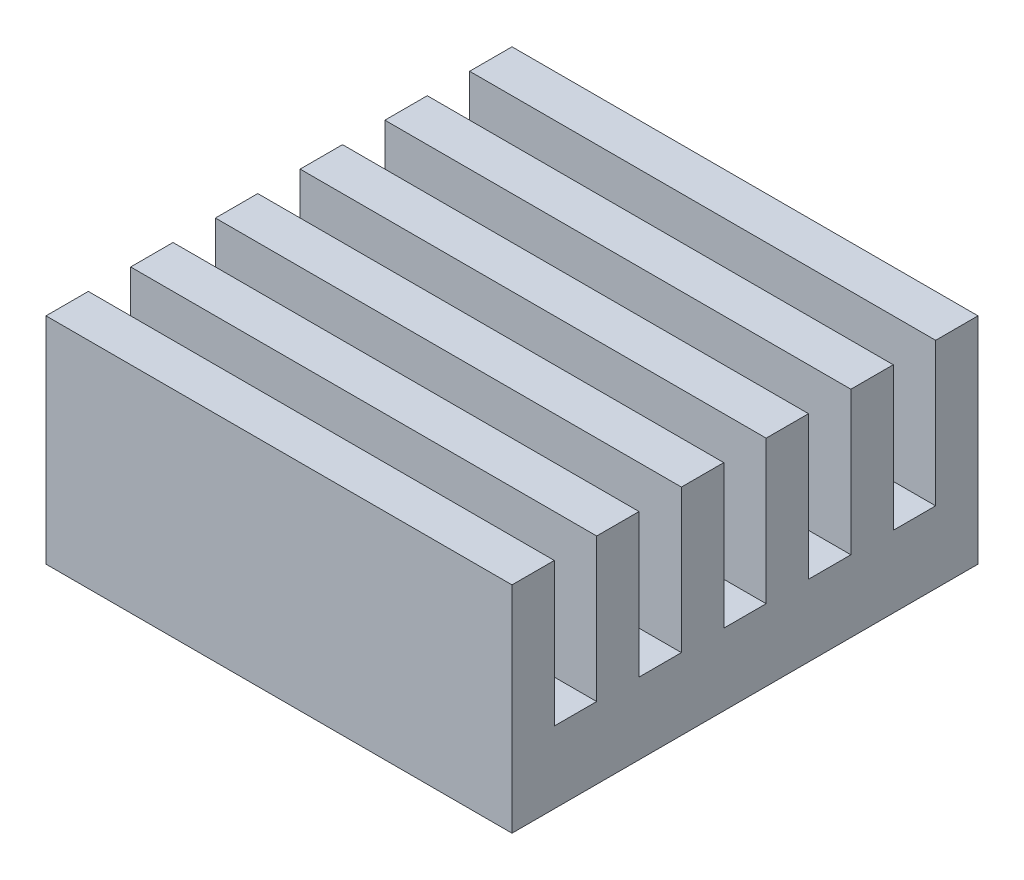
ISO-10303-21;
HEADER;
FILE_DESCRIPTION(('STEP AP214'),'2;1');
FILE_NAME('part.step','',(''),(''),'','','');
FILE_SCHEMA(('AUTOMOTIVE_DESIGN { 1 0 10303 214 1 1 1 1 }'));
ENDSEC;
DATA;
#1=APPLICATION_CONTEXT('core data for automotive mechanical design processes');
#2=APPLICATION_PROTOCOL_DEFINITION('international standard','automotive_design',2000,#1);
#3=PRODUCT_CONTEXT('',#1,'mechanical');
#4=PRODUCT('Part','Part','',(#3));
#5=PRODUCT_RELATED_PRODUCT_CATEGORY('part','',(#4));
#6=PRODUCT_DEFINITION_FORMATION('','',#4);
#7=PRODUCT_DEFINITION_CONTEXT('part definition',#1,'design');
#8=PRODUCT_DEFINITION('design','',#6,#7);
#9=PRODUCT_DEFINITION_SHAPE('','',#8);
#10=(LENGTH_UNIT() NAMED_UNIT(*) SI_UNIT(.MILLI.,.METRE.));
#11=(NAMED_UNIT(*) PLANE_ANGLE_UNIT() SI_UNIT($,.RADIAN.));
#12=(NAMED_UNIT(*) SI_UNIT($,.STERADIAN.) SOLID_ANGLE_UNIT());
#13=UNCERTAINTY_MEASURE_WITH_UNIT(LENGTH_MEASURE(1.E-05),#10,'distance_accuracy_value','');
#14=(GEOMETRIC_REPRESENTATION_CONTEXT(3) GLOBAL_UNCERTAINTY_ASSIGNED_CONTEXT((#13)) GLOBAL_UNIT_ASSIGNED_CONTEXT((#10,
#11,#12)) REPRESENTATION_CONTEXT('',''));
#15=CARTESIAN_POINT('',(0.,0.,0.));
#16=DIRECTION('',(0.,0.,1.));
#17=DIRECTION('',(1.,0.,0.));
#18=AXIS2_PLACEMENT_3D('',#15,#16,#17);
#19=CARTESIAN_POINT('',(0.,30.,0.));
#20=DIRECTION('',(0.,-1.,0.));
#21=DIRECTION('',(0.,0.,-1.));
#22=AXIS2_PLACEMENT_3D('',#19,#20,#21);
#23=PLANE('',#22);
#24=DIRECTION('',(0.,0.,1.));
#25=VECTOR('',#24,1.);
#26=CARTESIAN_POINT('',(-32.5,30.,32.5));
#27=LINE('',#26,#25);
#28=CARTESIAN_POINT('',(-32.5,30.,-32.5));
#29=VERTEX_POINT('',#28);
#30=CARTESIAN_POINT('',(-32.5,30.,-26.59));
#31=VERTEX_POINT('',#30);
#32=EDGE_CURVE('E387',#29,#31,#27,.T.);
#33=ORIENTED_EDGE('',*,*,#32,.T.);
#34=DIRECTION('',(-1.,0.,0.));
#35=VECTOR('',#34,1.);
#36=CARTESIAN_POINT('',(-32.5,30.,-26.59));
#37=LINE('',#36,#35);
#38=CARTESIAN_POINT('',(32.5,30.,-26.59));
#39=VERTEX_POINT('',#38);
#40=EDGE_CURVE('E256',#39,#31,#37,.T.);
#41=ORIENTED_EDGE('',*,*,#40,.F.);
#42=DIRECTION('',(0.,0.,-1.));
#43=VECTOR('',#42,1.);
#44=CARTESIAN_POINT('',(32.5,30.,32.5));
#45=LINE('',#44,#43);
#46=CARTESIAN_POINT('',(32.5,30.,-32.5));
#47=VERTEX_POINT('',#46);
#48=EDGE_CURVE('E384',#39,#47,#45,.T.);
#49=ORIENTED_EDGE('',*,*,#48,.T.);
#50=DIRECTION('',(-1.,0.,0.));
#51=VECTOR('',#50,1.);
#52=CARTESIAN_POINT('',(-32.5,30.,-32.5));
#53=LINE('',#52,#51);
#54=EDGE_CURVE('E382',#47,#29,#53,.T.);
#55=ORIENTED_EDGE('',*,*,#54,.T.);
#56=EDGE_LOOP('',(#33,#41,#49,#55));
#57=FACE_BOUND('',#56,.T.);
#58=ADVANCED_FACE('F39',(#57),#23,.F.);
#59=CARTESIAN_POINT('',(32.5000000000001,30.,-14.77));
#60=VERTEX_POINT('',#59);
#61=CARTESIAN_POINT('',(32.5,30.,-20.68));
#62=VERTEX_POINT('',#61);
#63=EDGE_CURVE('E469',#60,#62,#45,.T.);
#64=ORIENTED_EDGE('',*,*,#63,.T.);
#65=DIRECTION('',(1.,0.,0.));
#66=VECTOR('',#65,1.);
#67=CARTESIAN_POINT('',(-32.5,30.,-20.68));
#68=LINE('',#67,#66);
#69=CARTESIAN_POINT('',(-32.5,30.,-20.68));
#70=VERTEX_POINT('',#69);
#71=EDGE_CURVE('E265',#70,#62,#68,.T.);
#72=ORIENTED_EDGE('',*,*,#71,.F.);
#73=CARTESIAN_POINT('',(-32.4999999999999,30.,-14.77));
#74=VERTEX_POINT('',#73);
#75=EDGE_CURVE('E391',#70,#74,#27,.T.);
#76=ORIENTED_EDGE('',*,*,#75,.T.);
#77=DIRECTION('',(-1.,0.,0.));
#78=VECTOR('',#77,1.);
#79=CARTESIAN_POINT('',(-32.4999999999999,30.,-14.77));
#80=LINE('',#79,#78);
#81=EDGE_CURVE('E293',#60,#74,#80,.T.);
#82=ORIENTED_EDGE('',*,*,#81,.F.);
#83=EDGE_LOOP('',(#64,#72,#76,#82));
#84=FACE_BOUND('',#83,.T.);
#85=ADVANCED_FACE('F458',(#84),#23,.F.);
#86=CARTESIAN_POINT('',(32.5000000000003,30.,-2.95));
#87=VERTEX_POINT('',#86);
#88=CARTESIAN_POINT('',(32.5000000000001,30.,-8.86));
#89=VERTEX_POINT('',#88);
#90=EDGE_CURVE('E471',#87,#89,#45,.T.);
#91=ORIENTED_EDGE('',*,*,#90,.T.);
#92=DIRECTION('',(1.,0.,0.));
#93=VECTOR('',#92,1.);
#94=CARTESIAN_POINT('',(-32.4999999999999,30.,-8.86));
#95=LINE('',#94,#93);
#96=CARTESIAN_POINT('',(-32.5,30.,-8.86000000000001));
#97=VERTEX_POINT('',#96);
#98=EDGE_CURVE('E283',#97,#89,#95,.T.);
#99=ORIENTED_EDGE('',*,*,#98,.F.);
#100=CARTESIAN_POINT('',(-32.4999999999997,30.,-2.95));
#101=VERTEX_POINT('',#100);
#102=EDGE_CURVE('E442',#97,#101,#27,.T.);
#103=ORIENTED_EDGE('',*,*,#102,.T.);
#104=DIRECTION('',(-1.,0.,0.));
#105=VECTOR('',#104,1.);
#106=CARTESIAN_POINT('',(-32.4999999999997,30.,-2.95));
#107=LINE('',#106,#105);
#108=EDGE_CURVE('E319',#87,#101,#107,.T.);
#109=ORIENTED_EDGE('',*,*,#108,.F.);
#110=EDGE_LOOP('',(#91,#99,#103,#109));
#111=FACE_BOUND('',#110,.T.);
#112=ADVANCED_FACE('F490',(#111),#23,.F.);
#113=CARTESIAN_POINT('',(32.5000000000004,30.,8.87));
#114=VERTEX_POINT('',#113);
#115=CARTESIAN_POINT('',(32.5000000000003,30.,2.96));
#116=VERTEX_POINT('',#115);
#117=EDGE_CURVE('E473',#114,#116,#45,.T.);
#118=ORIENTED_EDGE('',*,*,#117,.T.);
#119=DIRECTION('',(1.,0.,0.));
#120=VECTOR('',#119,1.);
#121=CARTESIAN_POINT('',(-32.4999999999997,30.,2.96));
#122=LINE('',#121,#120);
#123=CARTESIAN_POINT('',(-32.5,30.,2.96));
#124=VERTEX_POINT('',#123);
#125=EDGE_CURVE('E309',#124,#116,#122,.T.);
#126=ORIENTED_EDGE('',*,*,#125,.F.);
#127=CARTESIAN_POINT('',(-32.4999999999996,30.,8.87));
#128=VERTEX_POINT('',#127);
#129=EDGE_CURVE('E436',#124,#128,#27,.T.);
#130=ORIENTED_EDGE('',*,*,#129,.T.);
#131=DIRECTION('',(-1.,0.,0.));
#132=VECTOR('',#131,1.);
#133=CARTESIAN_POINT('',(-32.4999999999996,30.,8.87));
#134=LINE('',#133,#132);
#135=EDGE_CURVE('E345',#114,#128,#134,.T.);
#136=ORIENTED_EDGE('',*,*,#135,.F.);
#137=EDGE_LOOP('',(#118,#126,#130,#136));
#138=FACE_BOUND('',#137,.T.);
#139=ADVANCED_FACE('F502',(#138),#23,.F.);
#140=CARTESIAN_POINT('',(32.5000000000005,30.,20.69));
#141=VERTEX_POINT('',#140);
#142=CARTESIAN_POINT('',(32.5000000000004,30.,14.78));
#143=VERTEX_POINT('',#142);
#144=EDGE_CURVE('E383',#141,#143,#45,.T.);
#145=ORIENTED_EDGE('',*,*,#144,.T.);
#146=DIRECTION('',(1.,0.,0.));
#147=VECTOR('',#146,1.);
#148=CARTESIAN_POINT('',(-32.4999999999996,30.,14.78));
#149=LINE('',#148,#147);
#150=CARTESIAN_POINT('',(-32.5,30.,14.78));
#151=VERTEX_POINT('',#150);
#152=EDGE_CURVE('E335',#151,#143,#149,.T.);
#153=ORIENTED_EDGE('',*,*,#152,.F.);
#154=CARTESIAN_POINT('',(-32.4999999999995,30.,20.69));
#155=VERTEX_POINT('',#154);
#156=EDGE_CURVE('E434',#151,#155,#27,.T.);
#157=ORIENTED_EDGE('',*,*,#156,.T.);
#158=DIRECTION('',(-1.,0.,0.));
#159=VECTOR('',#158,1.);
#160=CARTESIAN_POINT('',(-32.4999999999995,30.,20.69));
#161=LINE('',#160,#159);
#162=EDGE_CURVE('E244',#141,#155,#161,.T.);
#163=ORIENTED_EDGE('',*,*,#162,.F.);
#164=EDGE_LOOP('',(#145,#153,#157,#163));
#165=FACE_BOUND('',#164,.T.);
#166=ADVANCED_FACE('F484',(#165),#23,.F.);
#167=CARTESIAN_POINT('',(32.5,30.,32.5));
#168=DIRECTION('',(-1.,0.,0.));
#169=DIRECTION('',(0.,0.,1.));
#170=AXIS2_PLACEMENT_3D('',#167,#168,#169);
#171=PLANE('',#170);
#172=ORIENTED_EDGE('',*,*,#48,.F.);
#173=DIRECTION('',(0.,1.,0.));
#174=VECTOR('',#173,1.);
#175=CARTESIAN_POINT('',(32.5,10.,-26.59));
#176=LINE('',#175,#174);
#177=CARTESIAN_POINT('',(32.5,10.,-26.59));
#178=VERTEX_POINT('',#177);
#179=EDGE_CURVE('E273',#178,#39,#176,.T.);
#180=ORIENTED_EDGE('',*,*,#179,.F.);
#181=DIRECTION('',(0.,0.,-1.));
#182=VECTOR('',#181,1.);
#183=CARTESIAN_POINT('',(32.5,10.,-26.59));
#184=LINE('',#183,#182);
#185=CARTESIAN_POINT('',(32.5,10.,-20.68));
#186=VERTEX_POINT('',#185);
#187=EDGE_CURVE('E259',#186,#178,#184,.T.);
#188=ORIENTED_EDGE('',*,*,#187,.F.);
#189=DIRECTION('',(0.,1.,0.));
#190=VECTOR('',#189,1.);
#191=CARTESIAN_POINT('',(32.5,10.,-20.68));
#192=LINE('',#191,#190);
#193=EDGE_CURVE('E275',#186,#62,#192,.T.);
#194=ORIENTED_EDGE('',*,*,#193,.T.);
#195=ORIENTED_EDGE('',*,*,#63,.F.);
#196=DIRECTION('',(0.,1.,0.));
#197=VECTOR('',#196,1.);
#198=CARTESIAN_POINT('',(32.5000000000001,10.,-14.77));
#199=LINE('',#198,#197);
#200=CARTESIAN_POINT('',(32.5000000000001,10.,-14.77));
#201=VERTEX_POINT('',#200);
#202=EDGE_CURVE('E267',#201,#60,#199,.T.);
#203=ORIENTED_EDGE('',*,*,#202,.F.);
#204=DIRECTION('',(0.,0.,-1.));
#205=VECTOR('',#204,1.);
#206=CARTESIAN_POINT('',(32.5000000000001,10.,-14.77));
#207=LINE('',#206,#205);
#208=CARTESIAN_POINT('',(32.5000000000001,10.,-8.86));
#209=VERTEX_POINT('',#208);
#210=EDGE_CURVE('E289',#209,#201,#207,.T.);
#211=ORIENTED_EDGE('',*,*,#210,.F.);
#212=DIRECTION('',(0.,1.,0.));
#213=VECTOR('',#212,1.);
#214=CARTESIAN_POINT('',(32.5000000000001,10.,-8.86));
#215=LINE('',#214,#213);
#216=EDGE_CURVE('E298',#209,#89,#215,.T.);
#217=ORIENTED_EDGE('',*,*,#216,.T.);
#218=ORIENTED_EDGE('',*,*,#90,.F.);
#219=DIRECTION('',(0.,1.,0.));
#220=VECTOR('',#219,1.);
#221=CARTESIAN_POINT('',(32.5000000000003,10.,-2.95));
#222=LINE('',#221,#220);
#223=CARTESIAN_POINT('',(32.5000000000003,10.,-2.95));
#224=VERTEX_POINT('',#223);
#225=EDGE_CURVE('E295',#224,#87,#222,.T.);
#226=ORIENTED_EDGE('',*,*,#225,.F.);
#227=DIRECTION('',(0.,0.,-1.));
#228=VECTOR('',#227,1.);
#229=CARTESIAN_POINT('',(32.5000000000003,10.,-2.95));
#230=LINE('',#229,#228);
#231=CARTESIAN_POINT('',(32.5000000000003,10.,2.96));
#232=VERTEX_POINT('',#231);
#233=EDGE_CURVE('E315',#232,#224,#230,.T.);
#234=ORIENTED_EDGE('',*,*,#233,.F.);
#235=DIRECTION('',(0.,1.,0.));
#236=VECTOR('',#235,1.);
#237=CARTESIAN_POINT('',(32.5000000000003,10.,2.96));
#238=LINE('',#237,#236);
#239=EDGE_CURVE('E324',#232,#116,#238,.T.);
#240=ORIENTED_EDGE('',*,*,#239,.T.);
#241=ORIENTED_EDGE('',*,*,#117,.F.);
#242=DIRECTION('',(0.,1.,0.));
#243=VECTOR('',#242,1.);
#244=CARTESIAN_POINT('',(32.5000000000004,10.,8.87));
#245=LINE('',#244,#243);
#246=CARTESIAN_POINT('',(32.5000000000004,10.,8.87));
#247=VERTEX_POINT('',#246);
#248=EDGE_CURVE('E321',#247,#114,#245,.T.);
#249=ORIENTED_EDGE('',*,*,#248,.F.);
#250=DIRECTION('',(0.,0.,-1.));
#251=VECTOR('',#250,1.);
#252=CARTESIAN_POINT('',(32.5000000000004,10.,8.87));
#253=LINE('',#252,#251);
#254=CARTESIAN_POINT('',(32.5000000000004,10.,14.78));
#255=VERTEX_POINT('',#254);
#256=EDGE_CURVE('E341',#255,#247,#253,.T.);
#257=ORIENTED_EDGE('',*,*,#256,.F.);
#258=DIRECTION('',(0.,1.,0.));
#259=VECTOR('',#258,1.);
#260=CARTESIAN_POINT('',(32.5000000000004,10.,14.78));
#261=LINE('',#260,#259);
#262=EDGE_CURVE('E350',#255,#143,#261,.T.);
#263=ORIENTED_EDGE('',*,*,#262,.T.);
#264=ORIENTED_EDGE('',*,*,#144,.F.);
#265=DIRECTION('',(0.,1.,0.));
#266=VECTOR('',#265,1.);
#267=CARTESIAN_POINT('',(32.5000000000005,10.,20.69));
#268=LINE('',#267,#266);
#269=CARTESIAN_POINT('',(32.5000000000005,10.,20.69));
#270=VERTEX_POINT('',#269);
#271=EDGE_CURVE('E347',#270,#141,#268,.T.);
#272=ORIENTED_EDGE('',*,*,#271,.F.);
#273=DIRECTION('',(0.,0.,-1.));
#274=VECTOR('',#273,1.);
#275=CARTESIAN_POINT('',(32.5000000000005,10.,20.69));
#276=LINE('',#275,#274);
#277=CARTESIAN_POINT('',(32.5000000000005,10.,26.6));
#278=VERTEX_POINT('',#277);
#279=EDGE_CURVE('E366',#278,#270,#276,.T.);
#280=ORIENTED_EDGE('',*,*,#279,.F.);
#281=DIRECTION('',(0.,1.,0.));
#282=VECTOR('',#281,1.);
#283=CARTESIAN_POINT('',(32.5000000000005,10.,26.6));
#284=LINE('',#283,#282);
#285=CARTESIAN_POINT('',(32.5000000000005,30.,26.6));
#286=VERTEX_POINT('',#285);
#287=EDGE_CURVE('E372',#278,#286,#284,.T.);
#288=ORIENTED_EDGE('',*,*,#287,.T.);
#289=CARTESIAN_POINT('',(32.5,30.,32.5));
#290=VERTEX_POINT('',#289);
#291=EDGE_CURVE('E379',#290,#286,#45,.T.);
#292=ORIENTED_EDGE('',*,*,#291,.F.);
#293=DIRECTION('',(0.,-1.,0.));
#294=VECTOR('',#293,1.);
#295=CARTESIAN_POINT('',(32.5,30.,32.5));
#296=LINE('',#295,#294);
#297=CARTESIAN_POINT('',(32.5,0.,32.5));
#298=VERTEX_POINT('',#297);
#299=EDGE_CURVE('E393',#290,#298,#296,.T.);
#300=ORIENTED_EDGE('',*,*,#299,.T.);
#301=DIRECTION('',(0.,0.,-1.));
#302=VECTOR('',#301,1.);
#303=CARTESIAN_POINT('',(32.5,0.,32.5));
#304=LINE('',#303,#302);
#305=CARTESIAN_POINT('',(32.5,0.,-32.5));
#306=VERTEX_POINT('',#305);
#307=EDGE_CURVE('E272',#298,#306,#304,.T.);
#308=ORIENTED_EDGE('',*,*,#307,.T.);
#309=DIRECTION('',(0.,-1.,0.));
#310=VECTOR('',#309,1.);
#311=CARTESIAN_POINT('',(32.5,30.,-32.5));
#312=LINE('',#311,#310);
#313=EDGE_CURVE('E11',#47,#306,#312,.T.);
#314=ORIENTED_EDGE('',*,*,#313,.F.);
#315=EDGE_LOOP('',(#172,#180,#188,#194,#195,#203,#211,#217,#218,#226,#234,#240,#241,#249,#257,
#263,#264,#272,#280,#288,#292,#300,#308,#314));
#316=FACE_BOUND('',#315,.T.);
#317=ADVANCED_FACE('F41',(#316),#171,.F.);
#318=CARTESIAN_POINT('',(-32.5,30.,-32.5));
#319=DIRECTION('',(0.,0.,1.));
#320=DIRECTION('',(1.,0.,0.));
#321=AXIS2_PLACEMENT_3D('',#318,#319,#320);
#322=PLANE('',#321);
#323=DIRECTION('',(-1.,0.,0.));
#324=VECTOR('',#323,1.);
#325=CARTESIAN_POINT('',(-32.5,0.,-32.5));
#326=LINE('',#325,#324);
#327=CARTESIAN_POINT('',(-32.5,0.,-32.5));
#328=VERTEX_POINT('',#327);
#329=EDGE_CURVE('E396',#306,#328,#326,.T.);
#330=ORIENTED_EDGE('',*,*,#329,.T.);
#331=DIRECTION('',(0.,-1.,0.));
#332=VECTOR('',#331,1.);
#333=CARTESIAN_POINT('',(-32.5,30.,-32.5));
#334=LINE('',#333,#332);
#335=EDGE_CURVE('E47',#29,#328,#334,.T.);
#336=ORIENTED_EDGE('',*,*,#335,.F.);
#337=ORIENTED_EDGE('',*,*,#54,.F.);
#338=ORIENTED_EDGE('',*,*,#313,.T.);
#339=EDGE_LOOP('',(#330,#336,#337,#338));
#340=FACE_BOUND('',#339,.T.);
#341=ADVANCED_FACE('F477',(#340),#322,.F.);
#342=CARTESIAN_POINT('',(-32.5,30.,32.5));
#343=DIRECTION('',(1.,0.,0.));
#344=DIRECTION('',(0.,0.,-1.));
#345=AXIS2_PLACEMENT_3D('',#342,#343,#344);
#346=PLANE('',#345);
#347=DIRECTION('',(0.,0.,1.));
#348=VECTOR('',#347,1.);
#349=CARTESIAN_POINT('',(-32.5,10.,-26.59));
#350=LINE('',#349,#348);
#351=CARTESIAN_POINT('',(-32.5,10.,-26.59));
#352=VERTEX_POINT('',#351);
#353=CARTESIAN_POINT('',(-32.5,10.,-20.68));
#354=VERTEX_POINT('',#353);
#355=EDGE_CURVE('E252',#352,#354,#350,.T.);
#356=ORIENTED_EDGE('',*,*,#355,.F.);
#357=DIRECTION('',(0.,1.,0.));
#358=VECTOR('',#357,1.);
#359=CARTESIAN_POINT('',(-32.5,10.,-26.59));
#360=LINE('',#359,#358);
#361=EDGE_CURVE('E269',#352,#31,#360,.T.);
#362=ORIENTED_EDGE('',*,*,#361,.T.);
#363=ORIENTED_EDGE('',*,*,#32,.F.);
#364=ORIENTED_EDGE('',*,*,#335,.T.);
#365=DIRECTION('',(0.,0.,1.));
#366=VECTOR('',#365,1.);
#367=CARTESIAN_POINT('',(-32.5,0.,32.5));
#368=LINE('',#367,#366);
#369=CARTESIAN_POINT('',(-32.5,0.,32.5));
#370=VERTEX_POINT('',#369);
#371=EDGE_CURVE('E398',#328,#370,#368,.T.);
#372=ORIENTED_EDGE('',*,*,#371,.T.);
#373=DIRECTION('',(0.,-1.,0.));
#374=VECTOR('',#373,1.);
#375=CARTESIAN_POINT('',(-32.5,30.,32.5));
#376=LINE('',#375,#374);
#377=CARTESIAN_POINT('',(-32.5,30.,32.5));
#378=VERTEX_POINT('',#377);
#379=EDGE_CURVE('E404',#378,#370,#376,.T.);
#380=ORIENTED_EDGE('',*,*,#379,.F.);
#381=CARTESIAN_POINT('',(-32.5,30.,26.6));
#382=VERTEX_POINT('',#381);
#383=EDGE_CURVE('E386',#382,#378,#27,.T.);
#384=ORIENTED_EDGE('',*,*,#383,.F.);
#385=DIRECTION('',(0.,1.,0.));
#386=VECTOR('',#385,1.);
#387=CARTESIAN_POINT('',(-32.4999999999995,10.,26.6));
#388=LINE('',#387,#386);
#389=CARTESIAN_POINT('',(-32.4999999999995,10.,26.6));
#390=VERTEX_POINT('',#389);
#391=EDGE_CURVE('E375',#390,#382,#388,.T.);
#392=ORIENTED_EDGE('',*,*,#391,.F.);
#393=DIRECTION('',(0.,0.,1.));
#394=VECTOR('',#393,1.);
#395=CARTESIAN_POINT('',(-32.4999999999995,10.,20.69));
#396=LINE('',#395,#394);
#397=CARTESIAN_POINT('',(-32.4999999999995,10.,20.69));
#398=VERTEX_POINT('',#397);
#399=EDGE_CURVE('E360',#398,#390,#396,.T.);
#400=ORIENTED_EDGE('',*,*,#399,.F.);
#401=DIRECTION('',(0.,1.,0.));
#402=VECTOR('',#401,1.);
#403=CARTESIAN_POINT('',(-32.4999999999995,10.,20.69));
#404=LINE('',#403,#402);
#405=EDGE_CURVE('E368',#398,#155,#404,.T.);
#406=ORIENTED_EDGE('',*,*,#405,.T.);
#407=ORIENTED_EDGE('',*,*,#156,.F.);
#408=DIRECTION('',(0.,1.,0.));
#409=VECTOR('',#408,1.);
#410=CARTESIAN_POINT('',(-32.4999999999996,10.,14.78));
#411=LINE('',#410,#409);
#412=CARTESIAN_POINT('',(-32.4999999999996,10.,14.78));
#413=VERTEX_POINT('',#412);
#414=EDGE_CURVE('E353',#413,#151,#411,.T.);
#415=ORIENTED_EDGE('',*,*,#414,.F.);
#416=DIRECTION('',(0.,0.,1.));
#417=VECTOR('',#416,1.);
#418=CARTESIAN_POINT('',(-32.4999999999996,10.,8.87));
#419=LINE('',#418,#417);
#420=CARTESIAN_POINT('',(-32.4999999999996,10.,8.87));
#421=VERTEX_POINT('',#420);
#422=EDGE_CURVE('E334',#421,#413,#419,.T.);
#423=ORIENTED_EDGE('',*,*,#422,.F.);
#424=DIRECTION('',(0.,1.,0.));
#425=VECTOR('',#424,1.);
#426=CARTESIAN_POINT('',(-32.4999999999996,10.,8.87));
#427=LINE('',#426,#425);
#428=EDGE_CURVE('E344',#421,#128,#427,.T.);
#429=ORIENTED_EDGE('',*,*,#428,.T.);
#430=ORIENTED_EDGE('',*,*,#129,.F.);
#431=DIRECTION('',(0.,1.,0.));
#432=VECTOR('',#431,1.);
#433=CARTESIAN_POINT('',(-32.4999999999997,10.,2.96));
#434=LINE('',#433,#432);
#435=CARTESIAN_POINT('',(-32.4999999999997,10.,2.96));
#436=VERTEX_POINT('',#435);
#437=EDGE_CURVE('E327',#436,#124,#434,.T.);
#438=ORIENTED_EDGE('',*,*,#437,.F.);
#439=DIRECTION('',(0.,0.,1.));
#440=VECTOR('',#439,1.);
#441=CARTESIAN_POINT('',(-32.4999999999997,10.,-2.95));
#442=LINE('',#441,#440);
#443=CARTESIAN_POINT('',(-32.4999999999997,10.,-2.95));
#444=VERTEX_POINT('',#443);
#445=EDGE_CURVE('E308',#444,#436,#442,.T.);
#446=ORIENTED_EDGE('',*,*,#445,.F.);
#447=DIRECTION('',(0.,1.,0.));
#448=VECTOR('',#447,1.);
#449=CARTESIAN_POINT('',(-32.4999999999997,10.,-2.95));
#450=LINE('',#449,#448);
#451=EDGE_CURVE('E318',#444,#101,#450,.T.);
#452=ORIENTED_EDGE('',*,*,#451,.T.);
#453=ORIENTED_EDGE('',*,*,#102,.F.);
#454=DIRECTION('',(0.,1.,0.));
#455=VECTOR('',#454,1.);
#456=CARTESIAN_POINT('',(-32.4999999999999,10.,-8.86));
#457=LINE('',#456,#455);
#458=CARTESIAN_POINT('',(-32.4999999999999,10.,-8.86));
#459=VERTEX_POINT('',#458);
#460=EDGE_CURVE('E301',#459,#97,#457,.T.);
#461=ORIENTED_EDGE('',*,*,#460,.F.);
#462=DIRECTION('',(0.,0.,1.));
#463=VECTOR('',#462,1.);
#464=CARTESIAN_POINT('',(-32.4999999999999,10.,-14.77));
#465=LINE('',#464,#463);
#466=CARTESIAN_POINT('',(-32.4999999999999,10.,-14.77));
#467=VERTEX_POINT('',#466);
#468=EDGE_CURVE('E282',#467,#459,#465,.T.);
#469=ORIENTED_EDGE('',*,*,#468,.F.);
#470=DIRECTION('',(0.,1.,0.));
#471=VECTOR('',#470,1.);
#472=CARTESIAN_POINT('',(-32.4999999999999,10.,-14.77));
#473=LINE('',#472,#471);
#474=EDGE_CURVE('E292',#467,#74,#473,.T.);
#475=ORIENTED_EDGE('',*,*,#474,.T.);
#476=ORIENTED_EDGE('',*,*,#75,.F.);
#477=DIRECTION('',(0.,1.,0.));
#478=VECTOR('',#477,1.);
#479=CARTESIAN_POINT('',(-32.5,10.,-20.68));
#480=LINE('',#479,#478);
#481=EDGE_CURVE('E264',#354,#70,#480,.T.);
#482=ORIENTED_EDGE('',*,*,#481,.F.);
#483=EDGE_LOOP('',(#356,#362,#363,#364,#372,#380,#384,#392,#400,#406,#407,#415,#423,#429,#430,
#438,#446,#452,#453,#461,#469,#475,#476,#482));
#484=FACE_BOUND('',#483,.T.);
#485=ADVANCED_FACE('F412',(#484),#346,.F.);
#486=CARTESIAN_POINT('',(-32.5,30.,32.5));
#487=DIRECTION('',(0.,0.,-1.));
#488=DIRECTION('',(-1.,0.,0.));
#489=AXIS2_PLACEMENT_3D('',#486,#487,#488);
#490=PLANE('',#489);
#491=DIRECTION('',(1.,0.,0.));
#492=VECTOR('',#491,1.);
#493=CARTESIAN_POINT('',(-32.5,0.,32.5));
#494=LINE('',#493,#492);
#495=EDGE_CURVE('E400',#370,#298,#494,.T.);
#496=ORIENTED_EDGE('',*,*,#495,.T.);
#497=ORIENTED_EDGE('',*,*,#299,.F.);
#498=DIRECTION('',(1.,0.,0.));
#499=VECTOR('',#498,1.);
#500=CARTESIAN_POINT('',(-32.5,30.,32.5));
#501=LINE('',#500,#499);
#502=EDGE_CURVE('E390',#378,#290,#501,.T.);
#503=ORIENTED_EDGE('',*,*,#502,.F.);
#504=ORIENTED_EDGE('',*,*,#379,.T.);
#505=EDGE_LOOP('',(#496,#497,#503,#504));
#506=FACE_BOUND('',#505,.T.);
#507=ADVANCED_FACE('F422',(#506),#490,.F.);
#508=ORIENTED_EDGE('',*,*,#291,.T.);
#509=DIRECTION('',(1.,0.,0.));
#510=VECTOR('',#509,1.);
#511=CARTESIAN_POINT('',(-32.4999999999995,30.,26.6));
#512=LINE('',#511,#510);
#513=EDGE_CURVE('E246',#382,#286,#512,.T.);
#514=ORIENTED_EDGE('',*,*,#513,.F.);
#515=ORIENTED_EDGE('',*,*,#383,.T.);
#516=ORIENTED_EDGE('',*,*,#502,.T.);
#517=EDGE_LOOP('',(#508,#514,#515,#516));
#518=FACE_BOUND('',#517,.T.);
#519=ADVANCED_FACE('F431',(#518),#23,.F.);
#520=CARTESIAN_POINT('',(0.,0.,0.));
#521=DIRECTION('',(0.,-1.,0.));
#522=DIRECTION('',(0.,0.,-1.));
#523=AXIS2_PLACEMENT_3D('',#520,#521,#522);
#524=PLANE('',#523);
#525=DIRECTION('',(0.,0.,1.));
#526=VECTOR('',#525,1.);
#527=CARTESIAN_POINT('',(25.,0.,25.));
#528=LINE('',#527,#526);
#529=CARTESIAN_POINT('',(25.,0.,-25.));
#530=VERTEX_POINT('',#529);
#531=CARTESIAN_POINT('',(25.,0.,25.));
#532=VERTEX_POINT('',#531);
#533=EDGE_CURVE('E54',#530,#532,#528,.T.);
#534=ORIENTED_EDGE('',*,*,#533,.F.);
#535=DIRECTION('',(1.,0.,0.));
#536=VECTOR('',#535,1.);
#537=CARTESIAN_POINT('',(-25.,0.,-25.));
#538=LINE('',#537,#536);
#539=CARTESIAN_POINT('',(-25.,0.,-25.));
#540=VERTEX_POINT('',#539);
#541=EDGE_CURVE('E58',#540,#530,#538,.T.);
#542=ORIENTED_EDGE('',*,*,#541,.F.);
#543=DIRECTION('',(0.,0.,-1.));
#544=VECTOR('',#543,1.);
#545=CARTESIAN_POINT('',(-25.,0.,25.));
#546=LINE('',#545,#544);
#547=CARTESIAN_POINT('',(-25.,0.,25.));
#548=VERTEX_POINT('',#547);
#549=EDGE_CURVE('E772',#548,#540,#546,.T.);
#550=ORIENTED_EDGE('',*,*,#549,.F.);
#551=DIRECTION('',(-1.,0.,0.));
#552=VECTOR('',#551,1.);
#553=CARTESIAN_POINT('',(-25.,0.,25.));
#554=LINE('',#553,#552);
#555=EDGE_CURVE('E778',#532,#548,#554,.T.);
#556=ORIENTED_EDGE('',*,*,#555,.F.);
#557=EDGE_LOOP('',(#534,#542,#550,#556));
#558=FACE_BOUND('',#557,.T.);
#559=ORIENTED_EDGE('',*,*,#307,.F.);
#560=ORIENTED_EDGE('',*,*,#495,.F.);
#561=ORIENTED_EDGE('',*,*,#371,.F.);
#562=ORIENTED_EDGE('',*,*,#329,.F.);
#563=EDGE_LOOP('',(#559,#560,#561,#562));
#564=FACE_BOUND('',#563,.T.);
#565=ADVANCED_FACE('F419',(#558,#564),#524,.T.);
#566=CARTESIAN_POINT('',(-32.4999999999995,10.,20.69));
#567=DIRECTION('',(0.,0.,-1.));
#568=DIRECTION('',(-1.,0.,0.));
#569=AXIS2_PLACEMENT_3D('',#566,#567,#568);
#570=PLANE('',#569);
#571=ORIENTED_EDGE('',*,*,#162,.T.);
#572=ORIENTED_EDGE('',*,*,#405,.F.);
#573=DIRECTION('',(-1.,0.,0.));
#574=VECTOR('',#573,1.);
#575=CARTESIAN_POINT('',(-32.4999999999995,10.,20.69));
#576=LINE('',#575,#574);
#577=EDGE_CURVE('E357',#270,#398,#576,.T.);
#578=ORIENTED_EDGE('',*,*,#577,.F.);
#579=ORIENTED_EDGE('',*,*,#271,.T.);
#580=EDGE_LOOP('',(#571,#572,#578,#579));
#581=FACE_BOUND('',#580,.T.);
#582=ADVANCED_FACE('F499',(#581),#570,.F.);
#583=CARTESIAN_POINT('',(-32.4999999999995,10.,26.6));
#584=DIRECTION('',(0.,0.,1.));
#585=DIRECTION('',(1.,0.,0.));
#586=AXIS2_PLACEMENT_3D('',#583,#584,#585);
#587=PLANE('',#586);
#588=ORIENTED_EDGE('',*,*,#513,.T.);
#589=ORIENTED_EDGE('',*,*,#287,.F.);
#590=DIRECTION('',(1.,0.,0.));
#591=VECTOR('',#590,1.);
#592=CARTESIAN_POINT('',(-32.4999999999995,10.,26.6));
#593=LINE('',#592,#591);
#594=EDGE_CURVE('E363',#390,#278,#593,.T.);
#595=ORIENTED_EDGE('',*,*,#594,.F.);
#596=ORIENTED_EDGE('',*,*,#391,.T.);
#597=EDGE_LOOP('',(#588,#589,#595,#596));
#598=FACE_BOUND('',#597,.T.);
#599=ADVANCED_FACE('F534',(#598),#587,.F.);
#600=CARTESIAN_POINT('',(0.,10.,0.));
#601=DIRECTION('',(0.,-1.,0.));
#602=DIRECTION('',(0.,0.,-1.));
#603=AXIS2_PLACEMENT_3D('',#600,#601,#602);
#604=PLANE('',#603);
#605=ORIENTED_EDGE('',*,*,#577,.T.);
#606=ORIENTED_EDGE('',*,*,#399,.T.);
#607=ORIENTED_EDGE('',*,*,#594,.T.);
#608=ORIENTED_EDGE('',*,*,#279,.T.);
#609=EDGE_LOOP('',(#605,#606,#607,#608));
#610=FACE_BOUND('',#609,.T.);
#611=ADVANCED_FACE('F532',(#610),#604,.F.);
#612=CARTESIAN_POINT('',(-32.4999999999996,10.,8.87));
#613=DIRECTION('',(0.,0.,-1.));
#614=DIRECTION('',(-1.,0.,0.));
#615=AXIS2_PLACEMENT_3D('',#612,#613,#614);
#616=PLANE('',#615);
#617=ORIENTED_EDGE('',*,*,#135,.T.);
#618=ORIENTED_EDGE('',*,*,#428,.F.);
#619=DIRECTION('',(-1.,0.,0.));
#620=VECTOR('',#619,1.);
#621=CARTESIAN_POINT('',(-32.4999999999996,10.,8.87));
#622=LINE('',#621,#620);
#623=EDGE_CURVE('E331',#247,#421,#622,.T.);
#624=ORIENTED_EDGE('',*,*,#623,.F.);
#625=ORIENTED_EDGE('',*,*,#248,.T.);
#626=EDGE_LOOP('',(#617,#618,#624,#625));
#627=FACE_BOUND('',#626,.T.);
#628=ADVANCED_FACE('F524',(#627),#616,.F.);
#629=CARTESIAN_POINT('',(-32.4999999999996,10.,14.78));
#630=DIRECTION('',(0.,0.,1.));
#631=DIRECTION('',(1.,0.,0.));
#632=AXIS2_PLACEMENT_3D('',#629,#630,#631);
#633=PLANE('',#632);
#634=ORIENTED_EDGE('',*,*,#152,.T.);
#635=ORIENTED_EDGE('',*,*,#262,.F.);
#636=DIRECTION('',(1.,0.,0.));
#637=VECTOR('',#636,1.);
#638=CARTESIAN_POINT('',(-32.4999999999996,10.,14.78));
#639=LINE('',#638,#637);
#640=EDGE_CURVE('E338',#413,#255,#639,.T.);
#641=ORIENTED_EDGE('',*,*,#640,.F.);
#642=ORIENTED_EDGE('',*,*,#414,.T.);
#643=EDGE_LOOP('',(#634,#635,#641,#642));
#644=FACE_BOUND('',#643,.T.);
#645=ADVANCED_FACE('F528',(#644),#633,.F.);
#646=CARTESIAN_POINT('',(0.,10.,0.));
#647=DIRECTION('',(0.,-1.,0.));
#648=DIRECTION('',(0.,0.,-1.));
#649=AXIS2_PLACEMENT_3D('',#646,#647,#648);
#650=PLANE('',#649);
#651=ORIENTED_EDGE('',*,*,#623,.T.);
#652=ORIENTED_EDGE('',*,*,#422,.T.);
#653=ORIENTED_EDGE('',*,*,#640,.T.);
#654=ORIENTED_EDGE('',*,*,#256,.T.);
#655=EDGE_LOOP('',(#651,#652,#653,#654));
#656=FACE_BOUND('',#655,.T.);
#657=ADVANCED_FACE('F526',(#656),#650,.F.);
#658=CARTESIAN_POINT('',(-32.4999999999997,10.,-2.95));
#659=DIRECTION('',(0.,0.,-1.));
#660=DIRECTION('',(-1.,0.,0.));
#661=AXIS2_PLACEMENT_3D('',#658,#659,#660);
#662=PLANE('',#661);
#663=ORIENTED_EDGE('',*,*,#108,.T.);
#664=ORIENTED_EDGE('',*,*,#451,.F.);
#665=DIRECTION('',(-1.,0.,0.));
#666=VECTOR('',#665,1.);
#667=CARTESIAN_POINT('',(-32.4999999999997,10.,-2.95));
#668=LINE('',#667,#666);
#669=EDGE_CURVE('E305',#224,#444,#668,.T.);
#670=ORIENTED_EDGE('',*,*,#669,.F.);
#671=ORIENTED_EDGE('',*,*,#225,.T.);
#672=EDGE_LOOP('',(#663,#664,#670,#671));
#673=FACE_BOUND('',#672,.T.);
#674=ADVANCED_FACE('F549',(#673),#662,.F.);
#675=CARTESIAN_POINT('',(-32.4999999999997,10.,2.96));
#676=DIRECTION('',(0.,0.,1.));
#677=DIRECTION('',(1.,0.,0.));
#678=AXIS2_PLACEMENT_3D('',#675,#676,#677);
#679=PLANE('',#678);
#680=ORIENTED_EDGE('',*,*,#125,.T.);
#681=ORIENTED_EDGE('',*,*,#239,.F.);
#682=DIRECTION('',(1.,0.,0.));
#683=VECTOR('',#682,1.);
#684=CARTESIAN_POINT('',(-32.4999999999997,10.,2.96));
#685=LINE('',#684,#683);
#686=EDGE_CURVE('E312',#436,#232,#685,.T.);
#687=ORIENTED_EDGE('',*,*,#686,.F.);
#688=ORIENTED_EDGE('',*,*,#437,.T.);
#689=EDGE_LOOP('',(#680,#681,#687,#688));
#690=FACE_BOUND('',#689,.T.);
#691=ADVANCED_FACE('F516',(#690),#679,.F.);
#692=CARTESIAN_POINT('',(0.,10.,0.));
#693=DIRECTION('',(0.,-1.,0.));
#694=DIRECTION('',(0.,0.,-1.));
#695=AXIS2_PLACEMENT_3D('',#692,#693,#694);
#696=PLANE('',#695);
#697=ORIENTED_EDGE('',*,*,#669,.T.);
#698=ORIENTED_EDGE('',*,*,#445,.T.);
#699=ORIENTED_EDGE('',*,*,#686,.T.);
#700=ORIENTED_EDGE('',*,*,#233,.T.);
#701=EDGE_LOOP('',(#697,#698,#699,#700));
#702=FACE_BOUND('',#701,.T.);
#703=ADVANCED_FACE('F518',(#702),#696,.F.);
#704=CARTESIAN_POINT('',(-32.4999999999999,10.,-14.77));
#705=DIRECTION('',(0.,0.,-1.));
#706=DIRECTION('',(-1.,0.,0.));
#707=AXIS2_PLACEMENT_3D('',#704,#705,#706);
#708=PLANE('',#707);
#709=ORIENTED_EDGE('',*,*,#81,.T.);
#710=ORIENTED_EDGE('',*,*,#474,.F.);
#711=DIRECTION('',(-1.,0.,0.));
#712=VECTOR('',#711,1.);
#713=CARTESIAN_POINT('',(-32.4999999999999,10.,-14.77));
#714=LINE('',#713,#712);
#715=EDGE_CURVE('E279',#201,#467,#714,.T.);
#716=ORIENTED_EDGE('',*,*,#715,.F.);
#717=ORIENTED_EDGE('',*,*,#202,.T.);
#718=EDGE_LOOP('',(#709,#710,#716,#717));
#719=FACE_BOUND('',#718,.T.);
#720=ADVANCED_FACE('F464',(#719),#708,.F.);
#721=CARTESIAN_POINT('',(-32.4999999999999,10.,-8.86));
#722=DIRECTION('',(0.,0.,1.));
#723=DIRECTION('',(1.,0.,0.));
#724=AXIS2_PLACEMENT_3D('',#721,#722,#723);
#725=PLANE('',#724);
#726=ORIENTED_EDGE('',*,*,#98,.T.);
#727=ORIENTED_EDGE('',*,*,#216,.F.);
#728=DIRECTION('',(1.,0.,0.));
#729=VECTOR('',#728,1.);
#730=CARTESIAN_POINT('',(-32.4999999999999,10.,-8.86));
#731=LINE('',#730,#729);
#732=EDGE_CURVE('E286',#459,#209,#731,.T.);
#733=ORIENTED_EDGE('',*,*,#732,.F.);
#734=ORIENTED_EDGE('',*,*,#460,.T.);
#735=EDGE_LOOP('',(#726,#727,#733,#734));
#736=FACE_BOUND('',#735,.T.);
#737=ADVANCED_FACE('F559',(#736),#725,.F.);
#738=CARTESIAN_POINT('',(0.,10.,0.));
#739=DIRECTION('',(0.,-1.,0.));
#740=DIRECTION('',(0.,0.,-1.));
#741=AXIS2_PLACEMENT_3D('',#738,#739,#740);
#742=PLANE('',#741);
#743=ORIENTED_EDGE('',*,*,#715,.T.);
#744=ORIENTED_EDGE('',*,*,#468,.T.);
#745=ORIENTED_EDGE('',*,*,#732,.T.);
#746=ORIENTED_EDGE('',*,*,#210,.T.);
#747=EDGE_LOOP('',(#743,#744,#745,#746));
#748=FACE_BOUND('',#747,.T.);
#749=ADVANCED_FACE('F466',(#748),#742,.F.);
#750=CARTESIAN_POINT('',(-32.5,10.,-26.59));
#751=DIRECTION('',(0.,0.,-1.));
#752=DIRECTION('',(-1.,0.,0.));
#753=AXIS2_PLACEMENT_3D('',#750,#751,#752);
#754=PLANE('',#753);
#755=ORIENTED_EDGE('',*,*,#40,.T.);
#756=ORIENTED_EDGE('',*,*,#361,.F.);
#757=DIRECTION('',(-1.,0.,0.));
#758=VECTOR('',#757,1.);
#759=CARTESIAN_POINT('',(-32.5,10.,-26.59));
#760=LINE('',#759,#758);
#761=EDGE_CURVE('E261',#178,#352,#760,.T.);
#762=ORIENTED_EDGE('',*,*,#761,.F.);
#763=ORIENTED_EDGE('',*,*,#179,.T.);
#764=EDGE_LOOP('',(#755,#756,#762,#763));
#765=FACE_BOUND('',#764,.T.);
#766=ADVANCED_FACE('F565',(#765),#754,.F.);
#767=CARTESIAN_POINT('',(-32.5,10.,-20.68));
#768=DIRECTION('',(0.,0.,1.));
#769=DIRECTION('',(1.,0.,0.));
#770=AXIS2_PLACEMENT_3D('',#767,#768,#769);
#771=PLANE('',#770);
#772=ORIENTED_EDGE('',*,*,#71,.T.);
#773=ORIENTED_EDGE('',*,*,#193,.F.);
#774=DIRECTION('',(1.,0.,0.));
#775=VECTOR('',#774,1.);
#776=CARTESIAN_POINT('',(-32.5,10.,-20.68));
#777=LINE('',#776,#775);
#778=EDGE_CURVE('E255',#354,#186,#777,.T.);
#779=ORIENTED_EDGE('',*,*,#778,.F.);
#780=ORIENTED_EDGE('',*,*,#481,.T.);
#781=EDGE_LOOP('',(#772,#773,#779,#780));
#782=FACE_BOUND('',#781,.T.);
#783=ADVANCED_FACE('F566',(#782),#771,.F.);
#784=CARTESIAN_POINT('',(0.,10.,0.));
#785=DIRECTION('',(0.,1.,0.));
#786=DIRECTION('',(0.,0.,1.));
#787=AXIS2_PLACEMENT_3D('',#784,#785,#786);
#788=PLANE('',#787);
#789=ORIENTED_EDGE('',*,*,#355,.T.);
#790=ORIENTED_EDGE('',*,*,#778,.T.);
#791=ORIENTED_EDGE('',*,*,#187,.T.);
#792=ORIENTED_EDGE('',*,*,#761,.T.);
#793=EDGE_LOOP('',(#789,#790,#791,#792));
#794=FACE_BOUND('',#793,.T.);
#795=ADVANCED_FACE('F569',(#794),#788,.T.);
#796=CARTESIAN_POINT('',(25.,-1.,25.));
#797=DIRECTION('',(-1.,0.,0.));
#798=DIRECTION('',(0.,0.,1.));
#799=AXIS2_PLACEMENT_3D('',#796,#797,#798);
#800=PLANE('',#799);
#801=ORIENTED_EDGE('',*,*,#533,.T.);
#802=DIRECTION('',(0.,1.,0.));
#803=VECTOR('',#802,1.);
#804=CARTESIAN_POINT('',(25.,-1.,25.));
#805=LINE('',#804,#803);
#806=CARTESIAN_POINT('',(25.,-1.,25.));
#807=VERTEX_POINT('',#806);
#808=EDGE_CURVE('E227',#807,#532,#805,.T.);
#809=ORIENTED_EDGE('',*,*,#808,.F.);
#810=DIRECTION('',(0.,0.,1.));
#811=VECTOR('',#810,1.);
#812=CARTESIAN_POINT('',(25.,-1.,25.));
#813=LINE('',#812,#811);
#814=CARTESIAN_POINT('',(25.,-1.,-25.));
#815=VERTEX_POINT('',#814);
#816=EDGE_CURVE('E233',#815,#807,#813,.T.);
#817=ORIENTED_EDGE('',*,*,#816,.F.);
#818=DIRECTION('',(0.,1.,0.));
#819=VECTOR('',#818,1.);
#820=CARTESIAN_POINT('',(25.,-1.,-25.));
#821=LINE('',#820,#819);
#822=EDGE_CURVE('E770',#815,#530,#821,.T.);
#823=ORIENTED_EDGE('',*,*,#822,.T.);
#824=EDGE_LOOP('',(#801,#809,#817,#823));
#825=FACE_BOUND('',#824,.T.);
#826=ADVANCED_FACE('F243',(#825),#800,.F.);
#827=CARTESIAN_POINT('',(-25.,-1.,25.));
#828=DIRECTION('',(0.,0.,-1.));
#829=DIRECTION('',(-1.,0.,0.));
#830=AXIS2_PLACEMENT_3D('',#827,#828,#829);
#831=PLANE('',#830);
#832=ORIENTED_EDGE('',*,*,#555,.T.);
#833=DIRECTION('',(0.,1.,0.));
#834=VECTOR('',#833,1.);
#835=CARTESIAN_POINT('',(-25.,-1.,25.));
#836=LINE('',#835,#834);
#837=CARTESIAN_POINT('',(-25.,-1.,25.));
#838=VERTEX_POINT('',#837);
#839=EDGE_CURVE('E229',#838,#548,#836,.T.);
#840=ORIENTED_EDGE('',*,*,#839,.F.);
#841=DIRECTION('',(-1.,0.,0.));
#842=VECTOR('',#841,1.);
#843=CARTESIAN_POINT('',(-25.,-1.,25.));
#844=LINE('',#843,#842);
#845=EDGE_CURVE('E222',#807,#838,#844,.T.);
#846=ORIENTED_EDGE('',*,*,#845,.F.);
#847=ORIENTED_EDGE('',*,*,#808,.T.);
#848=EDGE_LOOP('',(#832,#840,#846,#847));
#849=FACE_BOUND('',#848,.T.);
#850=ADVANCED_FACE('F225',(#849),#831,.F.);
#851=CARTESIAN_POINT('',(-25.,-1.,25.));
#852=DIRECTION('',(1.,0.,0.));
#853=DIRECTION('',(0.,0.,-1.));
#854=AXIS2_PLACEMENT_3D('',#851,#852,#853);
#855=PLANE('',#854);
#856=ORIENTED_EDGE('',*,*,#549,.T.);
#857=DIRECTION('',(0.,1.,0.));
#858=VECTOR('',#857,1.);
#859=CARTESIAN_POINT('',(-25.,-1.,-25.));
#860=LINE('',#859,#858);
#861=CARTESIAN_POINT('',(-25.,-1.,-25.));
#862=VERTEX_POINT('',#861);
#863=EDGE_CURVE('E248',#862,#540,#860,.T.);
#864=ORIENTED_EDGE('',*,*,#863,.F.);
#865=DIRECTION('',(0.,0.,-1.));
#866=VECTOR('',#865,1.);
#867=CARTESIAN_POINT('',(-25.,-1.,25.));
#868=LINE('',#867,#866);
#869=EDGE_CURVE('E232',#838,#862,#868,.T.);
#870=ORIENTED_EDGE('',*,*,#869,.F.);
#871=ORIENTED_EDGE('',*,*,#839,.T.);
#872=EDGE_LOOP('',(#856,#864,#870,#871));
#873=FACE_BOUND('',#872,.T.);
#874=ADVANCED_FACE('F581',(#873),#855,.F.);
#875=CARTESIAN_POINT('',(-25.,-1.,-25.));
#876=DIRECTION('',(0.,0.,1.));
#877=DIRECTION('',(1.,0.,0.));
#878=AXIS2_PLACEMENT_3D('',#875,#876,#877);
#879=PLANE('',#878);
#880=ORIENTED_EDGE('',*,*,#541,.T.);
#881=ORIENTED_EDGE('',*,*,#822,.F.);
#882=DIRECTION('',(1.,0.,0.));
#883=VECTOR('',#882,1.);
#884=CARTESIAN_POINT('',(-25.,-1.,-25.));
#885=LINE('',#884,#883);
#886=EDGE_CURVE('E238',#862,#815,#885,.T.);
#887=ORIENTED_EDGE('',*,*,#886,.F.);
#888=ORIENTED_EDGE('',*,*,#863,.T.);
#889=EDGE_LOOP('',(#880,#881,#887,#888));
#890=FACE_BOUND('',#889,.T.);
#891=ADVANCED_FACE('F584',(#890),#879,.F.);
#892=CARTESIAN_POINT('',(0.,-1.,0.));
#893=DIRECTION('',(0.,-1.,0.));
#894=DIRECTION('',(0.,0.,-1.));
#895=AXIS2_PLACEMENT_3D('',#892,#893,#894);
#896=PLANE('',#895);
#897=ORIENTED_EDGE('',*,*,#816,.T.);
#898=ORIENTED_EDGE('',*,*,#845,.T.);
#899=ORIENTED_EDGE('',*,*,#869,.T.);
#900=ORIENTED_EDGE('',*,*,#886,.T.);
#901=EDGE_LOOP('',(#897,#898,#899,#900));
#902=FACE_BOUND('',#901,.T.);
#903=ADVANCED_FACE('F236',(#902),#896,.T.);
#904=CLOSED_SHELL('',(#58,#85,#112,#139,#166,#317,#341,#485,#507,#519,#565,#582,#599,#611,#628,
#645,#657,#674,#691,#703,#720,#737,#749,#766,#783,#795,#826,#850,#874,#891,#903));
#905=MANIFOLD_SOLID_BREP('B2',#904);
#906=ADVANCED_BREP_SHAPE_REPRESENTATION('',(#18,#905),#14);
#907=SHAPE_DEFINITION_REPRESENTATION(#9,#906);
ENDSEC;
END-ISO-10303-21;
